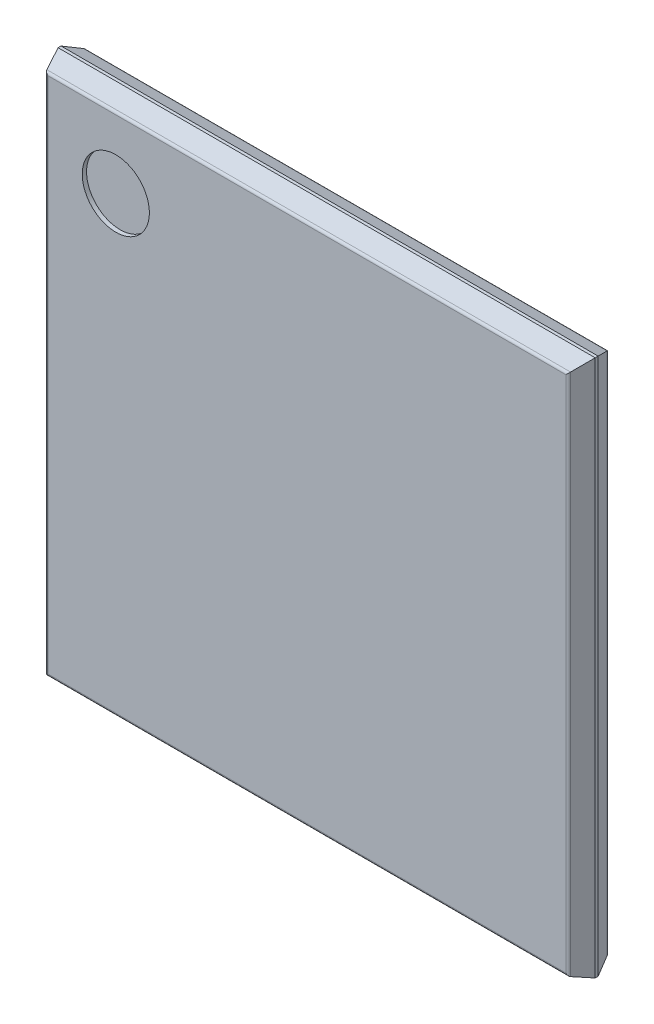
ISO-10303-21;
HEADER;
FILE_DESCRIPTION(('STEP AP214'),'2;1');
FILE_NAME('part.step','',(''),(''),'','','');
FILE_SCHEMA(('AUTOMOTIVE_DESIGN { 1 0 10303 214 1 1 1 1 }'));
ENDSEC;
DATA;
#1=APPLICATION_CONTEXT('core data for automotive mechanical design processes');
#2=APPLICATION_PROTOCOL_DEFINITION('international standard','automotive_design',2000,#1);
#3=PRODUCT_CONTEXT('',#1,'mechanical');
#4=PRODUCT('Part','Part','',(#3));
#5=PRODUCT_RELATED_PRODUCT_CATEGORY('part','',(#4));
#6=PRODUCT_DEFINITION_FORMATION('','',#4);
#7=PRODUCT_DEFINITION_CONTEXT('part definition',#1,'design');
#8=PRODUCT_DEFINITION('design','',#6,#7);
#9=PRODUCT_DEFINITION_SHAPE('','',#8);
#10=(LENGTH_UNIT() NAMED_UNIT(*) SI_UNIT(.MILLI.,.METRE.));
#11=(NAMED_UNIT(*) PLANE_ANGLE_UNIT() SI_UNIT($,.RADIAN.));
#12=(NAMED_UNIT(*) SI_UNIT($,.STERADIAN.) SOLID_ANGLE_UNIT());
#13=UNCERTAINTY_MEASURE_WITH_UNIT(LENGTH_MEASURE(1.E-05),#10,'distance_accuracy_value','');
#14=(GEOMETRIC_REPRESENTATION_CONTEXT(3) GLOBAL_UNCERTAINTY_ASSIGNED_CONTEXT((#13)) GLOBAL_UNIT_ASSIGNED_CONTEXT((#10,
#11,#12)) REPRESENTATION_CONTEXT('',''));
#15=CARTESIAN_POINT('',(0.,0.,0.));
#16=DIRECTION('',(0.,0.,1.));
#17=DIRECTION('',(1.,0.,0.));
#18=AXIS2_PLACEMENT_3D('',#15,#16,#17);
#19=CARTESIAN_POINT('',(-7.112,7.112,1.44));
#20=DIRECTION('',(0.,0.,1.));
#21=DIRECTION('',(1.,0.,0.));
#22=AXIS2_PLACEMENT_3D('',#19,#20,#21);
#23=PLANE('',#22);
#24=CARTESIAN_POINT('',(-7.112,7.112,1.44));
#25=DIRECTION('',(0.,0.,1.));
#26=DIRECTION('',(1.,0.,0.));
#27=AXIS2_PLACEMENT_3D('',#24,#25,#26);
#28=CIRCLE('',#27,1.25);
#29=CARTESIAN_POINT('',(-5.862,7.112,1.44));
#30=VERTEX_POINT('',#29);
#31=EDGE_CURVE('E25',#30,#30,#28,.T.);
#32=ORIENTED_EDGE('',*,*,#31,.T.);
#33=EDGE_LOOP('',(#32));
#34=FACE_BOUND('',#33,.T.);
#35=ADVANCED_FACE('F17',(#34),#23,.T.);
#36=CARTESIAN_POINT('',(-7.112,7.112,1.44));
#37=DIRECTION('',(0.,0.,1.));
#38=DIRECTION('',(1.,0.,0.));
#39=AXIS2_PLACEMENT_3D('',#36,#37,#38);
#40=CYLINDRICAL_SURFACE('',#39,1.25);
#41=ORIENTED_EDGE('',*,*,#31,.F.);
#42=DIRECTION('',(0.,0.,1.));
#43=VECTOR('',#42,1.);
#44=CARTESIAN_POINT('',(-5.862,7.112,1.44));
#45=LINE('',#44,#43);
#46=CARTESIAN_POINT('',(-5.862,7.112,1.6));
#47=VERTEX_POINT('',#46);
#48=EDGE_CURVE('E11',#30,#47,#45,.T.);
#49=ORIENTED_EDGE('',*,*,#48,.T.);
#50=CARTESIAN_POINT('',(-7.112,7.112,1.6));
#51=DIRECTION('',(0.,0.,1.));
#52=DIRECTION('',(1.,0.,0.));
#53=AXIS2_PLACEMENT_3D('',#50,#51,#52);
#54=CIRCLE('',#53,1.25);
#55=EDGE_CURVE('E263',#47,#47,#54,.T.);
#56=ORIENTED_EDGE('',*,*,#55,.T.);
#57=ORIENTED_EDGE('',*,*,#48,.F.);
#58=EDGE_LOOP('',(#41,#49,#56,#57));
#59=FACE_BOUND('',#58,.T.);
#60=ADVANCED_FACE('F335',(#59),#40,.F.);
#61=CARTESIAN_POINT('',(9.645902284743,-9.722,1.49));
#62=DIRECTION('',(0.,1.,0.));
#63=DIRECTION('',(0.,0.,1.));
#64=AXIS2_PLACEMENT_3D('',#61,#62,#63);
#65=CYLINDRICAL_SURFACE('',#64,0.11);
#66=CARTESIAN_POINT('',(9.645902284743,-9.645902284743,1.49));
#67=DIRECTION('',(-0.707106781186548,-0.707106781186548,0.));
#68=DIRECTION('',(0.707106781186548,-0.707106781186548,0.));
#69=AXIS2_PLACEMENT_3D('',#66,#67,#68);
#70=ELLIPSE('',#69,0.155563491861,0.11);
#71=CARTESIAN_POINT('',(9.748835540933,-9.748835540933,1.528791039818));
#72=VERTEX_POINT('',#71);
#73=CARTESIAN_POINT('',(9.645902284743,-9.645902284743,1.6));
#74=VERTEX_POINT('',#73);
#75=EDGE_CURVE('E215',#72,#74,#70,.T.);
#76=ORIENTED_EDGE('',*,*,#75,.F.);
#77=DIRECTION('',(0.,1.,0.));
#78=VECTOR('',#77,1.);
#79=CARTESIAN_POINT('',(9.748835540933,-9.722,1.528791039818));
#80=LINE('',#79,#78);
#81=CARTESIAN_POINT('',(9.748835540933,9.748835540933,1.528791039818));
#82=VERTEX_POINT('',#81);
#83=EDGE_CURVE('E220',#72,#82,#80,.T.);
#84=ORIENTED_EDGE('',*,*,#83,.T.);
#85=CARTESIAN_POINT('',(9.645902284743,9.645902284743,1.49));
#86=DIRECTION('',(-0.707106781186548,0.707106781186548,0.));
#87=DIRECTION('',(0.707106781186548,0.707106781186548,0.));
#88=AXIS2_PLACEMENT_3D('',#85,#86,#87);
#89=ELLIPSE('',#88,0.155563491861,0.11);
#90=CARTESIAN_POINT('',(9.645902284743,9.645902284743,1.6));
#91=VERTEX_POINT('',#90);
#92=EDGE_CURVE('E254',#91,#82,#89,.T.);
#93=ORIENTED_EDGE('',*,*,#92,.F.);
#94=DIRECTION('',(0.,1.,0.));
#95=VECTOR('',#94,1.);
#96=CARTESIAN_POINT('',(9.645902284743,-9.722,1.6));
#97=LINE('',#96,#95);
#98=EDGE_CURVE('E264',#74,#91,#97,.T.);
#99=ORIENTED_EDGE('',*,*,#98,.F.);
#100=EDGE_LOOP('',(#76,#84,#93,#99));
#101=FACE_BOUND('',#100,.T.);
#102=ADVANCED_FACE('F509',(#101),#65,.T.);
#103=CARTESIAN_POINT('',(-9.722,9.645902284743,1.49));
#104=DIRECTION('',(1.,0.,0.));
#105=DIRECTION('',(0.,0.,1.));
#106=AXIS2_PLACEMENT_3D('',#103,#104,#105);
#107=CYLINDRICAL_SURFACE('',#106,0.11);
#108=DIRECTION('',(1.,0.,0.));
#109=VECTOR('',#108,1.);
#110=CARTESIAN_POINT('',(-9.722,9.645902284743,1.6));
#111=LINE('',#110,#109);
#112=CARTESIAN_POINT('',(-9.645902284743,9.645902284743,1.6));
#113=VERTEX_POINT('',#112);
#114=EDGE_CURVE('E259',#113,#91,#111,.T.);
#115=ORIENTED_EDGE('',*,*,#114,.T.);
#116=ORIENTED_EDGE('',*,*,#92,.T.);
#117=DIRECTION('',(1.,0.,0.));
#118=VECTOR('',#117,1.);
#119=CARTESIAN_POINT('',(-9.722,9.748835540933,1.528791039818));
#120=LINE('',#119,#118);
#121=CARTESIAN_POINT('',(-9.748835540933,9.748835540933,1.528791039818));
#122=VERTEX_POINT('',#121);
#123=EDGE_CURVE('E316',#122,#82,#120,.T.);
#124=ORIENTED_EDGE('',*,*,#123,.F.);
#125=CARTESIAN_POINT('',(-9.645902284743,9.645902284743,1.49));
#126=DIRECTION('',(0.707106781186548,0.707106781186548,0.));
#127=DIRECTION('',(-0.707106781186548,0.707106781186548,0.));
#128=AXIS2_PLACEMENT_3D('',#125,#126,#127);
#129=ELLIPSE('',#128,0.155563491861,0.11);
#130=EDGE_CURVE('E269',#122,#113,#129,.T.);
#131=ORIENTED_EDGE('',*,*,#130,.T.);
#132=EDGE_LOOP('',(#115,#116,#124,#131));
#133=FACE_BOUND('',#132,.T.);
#134=ADVANCED_FACE('F341',(#133),#107,.T.);
#135=CARTESIAN_POINT('',(-10.,-10.,1.6));
#136=DIRECTION('',(0.,0.,1.));
#137=DIRECTION('',(1.,0.,0.));
#138=AXIS2_PLACEMENT_3D('',#135,#136,#137);
#139=PLANE('',#138);
#140=ORIENTED_EDGE('',*,*,#55,.F.);
#141=EDGE_LOOP('',(#140));
#142=FACE_BOUND('',#141,.T.);
#143=DIRECTION('',(0.,1.,0.));
#144=VECTOR('',#143,1.);
#145=CARTESIAN_POINT('',(-9.645902284743,-9.722,1.6));
#146=LINE('',#145,#144);
#147=CARTESIAN_POINT('',(-9.645902284743,-9.645902284743,1.6));
#148=VERTEX_POINT('',#147);
#149=EDGE_CURVE('E265',#148,#113,#146,.T.);
#150=ORIENTED_EDGE('',*,*,#149,.F.);
#151=DIRECTION('',(1.,0.,0.));
#152=VECTOR('',#151,1.);
#153=CARTESIAN_POINT('',(-9.722,-9.645902284743,1.6));
#154=LINE('',#153,#152);
#155=EDGE_CURVE('E219',#148,#74,#154,.T.);
#156=ORIENTED_EDGE('',*,*,#155,.T.);
#157=ORIENTED_EDGE('',*,*,#98,.T.);
#158=ORIENTED_EDGE('',*,*,#114,.F.);
#159=EDGE_LOOP('',(#150,#156,#157,#158));
#160=FACE_BOUND('',#159,.T.);
#161=ADVANCED_FACE('F337',(#142,#160),#139,.T.);
#162=CARTESIAN_POINT('',(-9.722,-9.645902284743,1.49));
#163=DIRECTION('',(1.,0.,0.));
#164=DIRECTION('',(0.,-0.935756874451536,0.352645816530825));
#165=AXIS2_PLACEMENT_3D('',#162,#163,#164);
#166=CYLINDRICAL_SURFACE('',#165,0.11);
#167=DIRECTION('',(1.,0.,0.));
#168=VECTOR('',#167,1.);
#169=CARTESIAN_POINT('',(-9.722,-9.748835540933,1.528791039818));
#170=LINE('',#169,#168);
#171=CARTESIAN_POINT('',(-9.748835540933,-9.748835540933,1.528791039818));
#172=VERTEX_POINT('',#171);
#173=EDGE_CURVE('E309',#172,#72,#170,.T.);
#174=ORIENTED_EDGE('',*,*,#173,.T.);
#175=ORIENTED_EDGE('',*,*,#75,.T.);
#176=ORIENTED_EDGE('',*,*,#155,.F.);
#177=CARTESIAN_POINT('',(-9.645902284743,-9.645902284743,1.49));
#178=DIRECTION('',(-0.707106781186548,0.707106781186548,0.));
#179=DIRECTION('',(0.707106781186548,0.707106781186548,0.));
#180=AXIS2_PLACEMENT_3D('',#177,#178,#179);
#181=ELLIPSE('',#180,0.155563491861,0.11);
#182=EDGE_CURVE('E270',#172,#148,#181,.T.);
#183=ORIENTED_EDGE('',*,*,#182,.F.);
#184=EDGE_LOOP('',(#174,#175,#176,#183));
#185=FACE_BOUND('',#184,.T.);
#186=ADVANCED_FACE('F340',(#185),#166,.T.);
#187=CARTESIAN_POINT('',(9.861,-10.,1.231159085259));
#188=DIRECTION('',(0.935756874451536,0.,0.352645816530825));
#189=DIRECTION('',(0.,-1.,0.));
#190=AXIS2_PLACEMENT_3D('',#187,#188,#189);
#191=PLANE('',#190);
#192=DIRECTION('',(-0.332572413353057,0.332572413353057,0.882491461575151));
#193=VECTOR('',#192,1.);
#194=CARTESIAN_POINT('',(8.770329911771,-8.770329911771,4.125286804851));
#195=LINE('',#194,#193);
#196=CARTESIAN_POINT('',(10.,-10.,0.862318170518));
#197=VERTEX_POINT('',#196);
#198=EDGE_CURVE('E305',#197,#72,#195,.T.);
#199=ORIENTED_EDGE('',*,*,#198,.F.);
#200=DIRECTION('',(0.,1.,0.));
#201=VECTOR('',#200,1.);
#202=CARTESIAN_POINT('',(10.,-10.,0.862318170518));
#203=LINE('',#202,#201);
#204=CARTESIAN_POINT('',(10.,10.,0.862318170518));
#205=VERTEX_POINT('',#204);
#206=EDGE_CURVE('E233',#197,#205,#203,.T.);
#207=ORIENTED_EDGE('',*,*,#206,.T.);
#208=DIRECTION('',(-0.332572413353057,-0.332572413353057,0.882491461575151));
#209=VECTOR('',#208,1.);
#210=CARTESIAN_POINT('',(7.664285810534,7.664285810534,7.060209956248));
#211=LINE('',#210,#209);
#212=EDGE_CURVE('E298',#205,#82,#211,.T.);
#213=ORIENTED_EDGE('',*,*,#212,.T.);
#214=ORIENTED_EDGE('',*,*,#83,.F.);
#215=EDGE_LOOP('',(#199,#207,#213,#214));
#216=FACE_BOUND('',#215,.T.);
#217=ADVANCED_FACE('F646',(#216),#191,.T.);
#218=CARTESIAN_POINT('',(-10.,9.861,1.231159085259));
#219=DIRECTION('',(0.,0.935756874451536,0.352645816530825));
#220=DIRECTION('',(1.,0.,0.));
#221=AXIS2_PLACEMENT_3D('',#218,#219,#220);
#222=PLANE('',#221);
#223=ORIENTED_EDGE('',*,*,#123,.T.);
#224=ORIENTED_EDGE('',*,*,#212,.F.);
#225=DIRECTION('',(1.,0.,0.));
#226=VECTOR('',#225,1.);
#227=CARTESIAN_POINT('',(-10.,10.,0.862318170518));
#228=LINE('',#227,#226);
#229=CARTESIAN_POINT('',(-10.,10.,0.862318170518));
#230=VERTEX_POINT('',#229);
#231=EDGE_CURVE('E229',#230,#205,#228,.T.);
#232=ORIENTED_EDGE('',*,*,#231,.F.);
#233=DIRECTION('',(0.332572413353057,-0.332572413353057,0.882491461575151));
#234=VECTOR('',#233,1.);
#235=CARTESIAN_POINT('',(-8.770329911771,8.770329911771,4.125286804851));
#236=LINE('',#235,#234);
#237=EDGE_CURVE('E285',#230,#122,#236,.T.);
#238=ORIENTED_EDGE('',*,*,#237,.T.);
#239=EDGE_LOOP('',(#223,#224,#232,#238));
#240=FACE_BOUND('',#239,.T.);
#241=ADVANCED_FACE('F533',(#240),#222,.T.);
#242=CARTESIAN_POINT('',(-9.645902284743,-9.722,1.49));
#243=DIRECTION('',(0.,1.,0.));
#244=DIRECTION('',(-0.935756874451536,0.,0.352645816530825));
#245=AXIS2_PLACEMENT_3D('',#242,#243,#244);
#246=CYLINDRICAL_SURFACE('',#245,0.11);
#247=ORIENTED_EDGE('',*,*,#182,.T.);
#248=ORIENTED_EDGE('',*,*,#149,.T.);
#249=ORIENTED_EDGE('',*,*,#130,.F.);
#250=DIRECTION('',(0.,1.,0.));
#251=VECTOR('',#250,1.);
#252=CARTESIAN_POINT('',(-9.748835540933,-9.722,1.528791039818));
#253=LINE('',#252,#251);
#254=EDGE_CURVE('E281',#172,#122,#253,.T.);
#255=ORIENTED_EDGE('',*,*,#254,.F.);
#256=EDGE_LOOP('',(#247,#248,#249,#255));
#257=FACE_BOUND('',#256,.T.);
#258=ADVANCED_FACE('F347',(#257),#246,.T.);
#259=CARTESIAN_POINT('',(-10.,-9.861,1.231159085259));
#260=DIRECTION('',(0.,0.935756874451536,-0.352645816530825));
#261=DIRECTION('',(-1.,0.,0.));
#262=AXIS2_PLACEMENT_3D('',#259,#260,#261);
#263=PLANE('',#262);
#264=DIRECTION('',(0.332572413353057,0.332572413353057,0.882491461575151));
#265=VECTOR('',#264,1.);
#266=CARTESIAN_POINT('',(-9.876374013007,-9.876374013007,1.190363653454));
#267=LINE('',#266,#265);
#268=CARTESIAN_POINT('',(-10.,-10.,0.862318170518));
#269=VERTEX_POINT('',#268);
#270=EDGE_CURVE('E291',#269,#172,#267,.T.);
#271=ORIENTED_EDGE('',*,*,#270,.F.);
#272=DIRECTION('',(1.,0.,0.));
#273=VECTOR('',#272,1.);
#274=CARTESIAN_POINT('',(-10.,-10.,0.862318170518));
#275=LINE('',#274,#273);
#276=EDGE_CURVE('E147',#269,#197,#275,.T.);
#277=ORIENTED_EDGE('',*,*,#276,.T.);
#278=ORIENTED_EDGE('',*,*,#198,.T.);
#279=ORIENTED_EDGE('',*,*,#173,.F.);
#280=EDGE_LOOP('',(#271,#277,#278,#279));
#281=FACE_BOUND('',#280,.T.);
#282=ADVANCED_FACE('F351',(#281),#263,.F.);
#283=CARTESIAN_POINT('',(10.,-10.,0.1));
#284=DIRECTION('',(1.,0.,0.));
#285=DIRECTION('',(0.,1.,0.));
#286=AXIS2_PLACEMENT_3D('',#283,#284,#285);
#287=PLANE('',#286);
#288=DIRECTION('',(0.,0.,1.));
#289=VECTOR('',#288,1.);
#290=CARTESIAN_POINT('',(10.,-10.,0.1));
#291=LINE('',#290,#289);
#292=CARTESIAN_POINT('',(10.,-10.,0.752318170518));
#293=VERTEX_POINT('',#292);
#294=EDGE_CURVE('E244',#293,#197,#291,.T.);
#295=ORIENTED_EDGE('',*,*,#294,.F.);
#296=DIRECTION('',(0.,1.,0.));
#297=VECTOR('',#296,1.);
#298=CARTESIAN_POINT('',(10.,-10.,0.752318170518));
#299=LINE('',#298,#297);
#300=CARTESIAN_POINT('',(10.,10.,0.752318170518));
#301=VERTEX_POINT('',#300);
#302=EDGE_CURVE('E251',#293,#301,#299,.T.);
#303=ORIENTED_EDGE('',*,*,#302,.T.);
#304=DIRECTION('',(0.,0.,1.));
#305=VECTOR('',#304,1.);
#306=CARTESIAN_POINT('',(10.,10.,0.1));
#307=LINE('',#306,#305);
#308=EDGE_CURVE('E234',#301,#205,#307,.T.);
#309=ORIENTED_EDGE('',*,*,#308,.T.);
#310=ORIENTED_EDGE('',*,*,#206,.F.);
#311=EDGE_LOOP('',(#295,#303,#309,#310));
#312=FACE_BOUND('',#311,.T.);
#313=ADVANCED_FACE('F546',(#312),#287,.T.);
#314=CARTESIAN_POINT('',(9.649306236035,-9.722,0.21));
#315=DIRECTION('',(0.,1.,0.));
#316=DIRECTION('',(0.,0.,-1.));
#317=AXIS2_PLACEMENT_3D('',#314,#315,#316);
#318=CYLINDRICAL_SURFACE('',#317,0.11);
#319=DIRECTION('',(0.,1.,0.));
#320=VECTOR('',#319,1.);
#321=CARTESIAN_POINT('',(9.649306236035,-9.722,0.1));
#322=LINE('',#321,#320);
#323=CARTESIAN_POINT('',(9.649306236035,-9.649306236035,0.1));
#324=VERTEX_POINT('',#323);
#325=CARTESIAN_POINT('',(9.649306236035,9.649306236035,0.1));
#326=VERTEX_POINT('',#325);
#327=EDGE_CURVE('E274',#324,#326,#322,.T.);
#328=ORIENTED_EDGE('',*,*,#327,.T.);
#329=CARTESIAN_POINT('',(9.649306236035,9.649306236035,0.21));
#330=DIRECTION('',(0.707106781186548,-0.707106781186548,0.));
#331=DIRECTION('',(0.707106781186548,0.707106781186548,0.));
#332=AXIS2_PLACEMENT_3D('',#329,#330,#331);
#333=ELLIPSE('',#332,0.155563491861,0.11);
#334=CARTESIAN_POINT('',(9.750499879527,9.750499879527,0.166874062134));
#335=VERTEX_POINT('',#334);
#336=EDGE_CURVE('E278',#326,#335,#333,.T.);
#337=ORIENTED_EDGE('',*,*,#336,.T.);
#338=DIRECTION('',(0.,1.,0.));
#339=VECTOR('',#338,1.);
#340=CARTESIAN_POINT('',(9.750499879527,-9.722,0.166874062134));
#341=LINE('',#340,#339);
#342=CARTESIAN_POINT('',(9.750499879527,-9.750499879527,0.166874062134));
#343=VERTEX_POINT('',#342);
#344=EDGE_CURVE('E247',#343,#335,#341,.T.);
#345=ORIENTED_EDGE('',*,*,#344,.F.);
#346=CARTESIAN_POINT('',(9.649306236035,-9.649306236035,0.21));
#347=DIRECTION('',(0.707106781186548,0.707106781186548,0.));
#348=DIRECTION('',(0.707106781186548,-0.707106781186548,0.));
#349=AXIS2_PLACEMENT_3D('',#346,#347,#348);
#350=ELLIPSE('',#349,0.155563491861,0.11);
#351=EDGE_CURVE('E238',#343,#324,#350,.T.);
#352=ORIENTED_EDGE('',*,*,#351,.T.);
#353=EDGE_LOOP('',(#328,#337,#345,#352));
#354=FACE_BOUND('',#353,.T.);
#355=ADVANCED_FACE('F551',(#354),#318,.T.);
#356=CARTESIAN_POINT('',(-10.,10.,0.1));
#357=DIRECTION('',(0.,1.,0.));
#358=DIRECTION('',(1.,0.,0.));
#359=AXIS2_PLACEMENT_3D('',#356,#357,#358);
#360=PLANE('',#359);
#361=ORIENTED_EDGE('',*,*,#308,.F.);
#362=DIRECTION('',(1.,0.,0.));
#363=VECTOR('',#362,1.);
#364=CARTESIAN_POINT('',(-10.,10.,0.752318170518));
#365=LINE('',#364,#363);
#366=CARTESIAN_POINT('',(-10.,10.,0.752318170518));
#367=VERTEX_POINT('',#366);
#368=EDGE_CURVE('E153',#367,#301,#365,.T.);
#369=ORIENTED_EDGE('',*,*,#368,.F.);
#370=DIRECTION('',(0.,0.,1.));
#371=VECTOR('',#370,1.);
#372=CARTESIAN_POINT('',(-10.,10.,0.1));
#373=LINE('',#372,#371);
#374=EDGE_CURVE('E154',#367,#230,#373,.T.);
#375=ORIENTED_EDGE('',*,*,#374,.T.);
#376=ORIENTED_EDGE('',*,*,#231,.T.);
#377=EDGE_LOOP('',(#361,#369,#375,#376));
#378=FACE_BOUND('',#377,.T.);
#379=ADVANCED_FACE('F357',(#378),#360,.T.);
#380=CARTESIAN_POINT('',(-9.861,-10.,1.231159085259));
#381=DIRECTION('',(0.935756874451536,0.,-0.352645816530825));
#382=DIRECTION('',(0.,-1.,0.));
#383=AXIS2_PLACEMENT_3D('',#380,#381,#382);
#384=PLANE('',#383);
#385=ORIENTED_EDGE('',*,*,#254,.T.);
#386=ORIENTED_EDGE('',*,*,#237,.F.);
#387=DIRECTION('',(0.,1.,0.));
#388=VECTOR('',#387,1.);
#389=CARTESIAN_POINT('',(-10.,-10.,0.862318170518));
#390=LINE('',#389,#388);
#391=EDGE_CURVE('E210',#269,#230,#390,.T.);
#392=ORIENTED_EDGE('',*,*,#391,.F.);
#393=ORIENTED_EDGE('',*,*,#270,.T.);
#394=EDGE_LOOP('',(#385,#386,#392,#393));
#395=FACE_BOUND('',#394,.T.);
#396=ADVANCED_FACE('F353',(#395),#384,.F.);
#397=CARTESIAN_POINT('',(-9.722,9.649306236035,0.21));
#398=DIRECTION('',(1.,0.,0.));
#399=DIRECTION('',(0.,0.,-1.));
#400=AXIS2_PLACEMENT_3D('',#397,#398,#399);
#401=CYLINDRICAL_SURFACE('',#400,0.11);
#402=CARTESIAN_POINT('',(-9.649306236035,9.649306236035,0.21));
#403=DIRECTION('',(-0.707106781186548,-0.707106781186548,0.));
#404=DIRECTION('',(-0.707106781186548,0.707106781186548,0.));
#405=AXIS2_PLACEMENT_3D('',#402,#403,#404);
#406=ELLIPSE('',#405,0.155563491861,0.11);
#407=CARTESIAN_POINT('',(-9.750499879527,9.750499879527,0.166874062134));
#408=VERTEX_POINT('',#407);
#409=CARTESIAN_POINT('',(-9.649306236035,9.649306236035,0.1));
#410=VERTEX_POINT('',#409);
#411=EDGE_CURVE('E165',#408,#410,#406,.T.);
#412=ORIENTED_EDGE('',*,*,#411,.F.);
#413=DIRECTION('',(1.,0.,0.));
#414=VECTOR('',#413,1.);
#415=CARTESIAN_POINT('',(-9.722,9.750499879527,0.166874062134));
#416=LINE('',#415,#414);
#417=EDGE_CURVE('E224',#408,#335,#416,.T.);
#418=ORIENTED_EDGE('',*,*,#417,.T.);
#419=ORIENTED_EDGE('',*,*,#336,.F.);
#420=DIRECTION('',(1.,0.,0.));
#421=VECTOR('',#420,1.);
#422=CARTESIAN_POINT('',(-9.722,9.649306236035,0.1));
#423=LINE('',#422,#421);
#424=EDGE_CURVE('E258',#410,#326,#423,.T.);
#425=ORIENTED_EDGE('',*,*,#424,.F.);
#426=EDGE_LOOP('',(#412,#418,#419,#425));
#427=FACE_BOUND('',#426,.T.);
#428=ADVANCED_FACE('F363',(#427),#401,.T.);
#429=CARTESIAN_POINT('',(-10.,-10.,0.1));
#430=DIRECTION('',(0.,0.,1.));
#431=DIRECTION('',(1.,0.,0.));
#432=AXIS2_PLACEMENT_3D('',#429,#430,#431);
#433=PLANE('',#432);
#434=ORIENTED_EDGE('',*,*,#424,.T.);
#435=ORIENTED_EDGE('',*,*,#327,.F.);
#436=DIRECTION('',(1.,0.,0.));
#437=VECTOR('',#436,1.);
#438=CARTESIAN_POINT('',(-9.722,-9.649306236035,0.1));
#439=LINE('',#438,#437);
#440=CARTESIAN_POINT('',(-9.649306236035,-9.649306236035,0.1));
#441=VERTEX_POINT('',#440);
#442=EDGE_CURVE('E228',#441,#324,#439,.T.);
#443=ORIENTED_EDGE('',*,*,#442,.F.);
#444=DIRECTION('',(0.,1.,0.));
#445=VECTOR('',#444,1.);
#446=CARTESIAN_POINT('',(-9.649306236035,-9.722,0.1));
#447=LINE('',#446,#445);
#448=EDGE_CURVE('E198',#441,#410,#447,.T.);
#449=ORIENTED_EDGE('',*,*,#448,.T.);
#450=EDGE_LOOP('',(#434,#435,#443,#449));
#451=FACE_BOUND('',#450,.T.);
#452=ADVANCED_FACE('F581',(#451),#433,.F.);
#453=CARTESIAN_POINT('',(9.861,-10.,0.426159085259));
#454=DIRECTION('',(-0.919942213562356,0.,0.392053980602152));
#455=DIRECTION('',(0.,1.,0.));
#456=AXIS2_PLACEMENT_3D('',#453,#454,#455);
#457=PLANE('',#456);
#458=ORIENTED_EDGE('',*,*,#344,.T.);
#459=DIRECTION('',(-0.365004510426897,-0.365004510426897,-0.856471490906757));
#460=VECTOR('',#459,1.);
#461=CARTESIAN_POINT('',(7.21495288004,7.21495288004,-5.782706441343));
#462=LINE('',#461,#460);
#463=EDGE_CURVE('E202',#301,#335,#462,.T.);
#464=ORIENTED_EDGE('',*,*,#463,.F.);
#465=ORIENTED_EDGE('',*,*,#302,.F.);
#466=DIRECTION('',(-0.365004510426897,0.365004510426897,-0.856471490906757));
#467=VECTOR('',#466,1.);
#468=CARTESIAN_POINT('',(8.547235806358,-8.547235806358,-2.656546869014));
#469=LINE('',#468,#467);
#470=EDGE_CURVE('E163',#293,#343,#469,.T.);
#471=ORIENTED_EDGE('',*,*,#470,.T.);
#472=EDGE_LOOP('',(#458,#464,#465,#471));
#473=FACE_BOUND('',#472,.T.);
#474=ADVANCED_FACE('F598',(#473),#457,.F.);
#475=CARTESIAN_POINT('',(-10.,-10.,0.1));
#476=DIRECTION('',(0.,1.,0.));
#477=DIRECTION('',(1.,0.,0.));
#478=AXIS2_PLACEMENT_3D('',#475,#476,#477);
#479=PLANE('',#478);
#480=ORIENTED_EDGE('',*,*,#276,.F.);
#481=DIRECTION('',(0.,0.,1.));
#482=VECTOR('',#481,1.);
#483=CARTESIAN_POINT('',(-10.,-10.,0.1));
#484=LINE('',#483,#482);
#485=CARTESIAN_POINT('',(-10.,-10.,0.752318170518));
#486=VERTEX_POINT('',#485);
#487=EDGE_CURVE('E140',#486,#269,#484,.T.);
#488=ORIENTED_EDGE('',*,*,#487,.F.);
#489=DIRECTION('',(1.,0.,0.));
#490=VECTOR('',#489,1.);
#491=CARTESIAN_POINT('',(-10.,-10.,0.752318170518));
#492=LINE('',#491,#490);
#493=EDGE_CURVE('E144',#486,#293,#492,.T.);
#494=ORIENTED_EDGE('',*,*,#493,.T.);
#495=ORIENTED_EDGE('',*,*,#294,.T.);
#496=EDGE_LOOP('',(#480,#488,#494,#495));
#497=FACE_BOUND('',#496,.T.);
#498=ADVANCED_FACE('F142',(#497),#479,.F.);
#499=CARTESIAN_POINT('',(-9.722,-9.649306236035,0.21));
#500=DIRECTION('',(1.,0.,0.));
#501=DIRECTION('',(0.,-0.919942213562356,-0.392053980602152));
#502=AXIS2_PLACEMENT_3D('',#499,#500,#501);
#503=CYLINDRICAL_SURFACE('',#502,0.11);
#504=CARTESIAN_POINT('',(-9.649306236035,-9.649306236035,0.21));
#505=DIRECTION('',(0.707106781186548,-0.707106781186548,0.));
#506=DIRECTION('',(0.707106781186548,0.707106781186548,0.));
#507=AXIS2_PLACEMENT_3D('',#504,#505,#506);
#508=ELLIPSE('',#507,0.155563491861,0.11);
#509=CARTESIAN_POINT('',(-9.750499879527,-9.750499879527,0.166874062134));
#510=VERTEX_POINT('',#509);
#511=EDGE_CURVE('E206',#510,#441,#508,.T.);
#512=ORIENTED_EDGE('',*,*,#511,.T.);
#513=ORIENTED_EDGE('',*,*,#442,.T.);
#514=ORIENTED_EDGE('',*,*,#351,.F.);
#515=DIRECTION('',(1.,0.,0.));
#516=VECTOR('',#515,1.);
#517=CARTESIAN_POINT('',(-9.722,-9.750499879527,0.166874062134));
#518=LINE('',#517,#516);
#519=EDGE_CURVE('E192',#510,#343,#518,.T.);
#520=ORIENTED_EDGE('',*,*,#519,.F.);
#521=EDGE_LOOP('',(#512,#513,#514,#520));
#522=FACE_BOUND('',#521,.T.);
#523=ADVANCED_FACE('F572',(#522),#503,.T.);
#524=CARTESIAN_POINT('',(-10.,9.861,0.426159085259));
#525=DIRECTION('',(0.,-0.919942213562356,0.392053980602152));
#526=DIRECTION('',(-1.,0.,0.));
#527=AXIS2_PLACEMENT_3D('',#524,#525,#526);
#528=PLANE('',#527);
#529=DIRECTION('',(0.365004510426897,-0.365004510426897,-0.856471490906757));
#530=VECTOR('',#529,1.);
#531=CARTESIAN_POINT('',(-8.547235806358,8.547235806358,-2.656546869014));
#532=LINE('',#531,#530);
#533=EDGE_CURVE('E176',#367,#408,#532,.T.);
#534=ORIENTED_EDGE('',*,*,#533,.F.);
#535=ORIENTED_EDGE('',*,*,#368,.T.);
#536=ORIENTED_EDGE('',*,*,#463,.T.);
#537=ORIENTED_EDGE('',*,*,#417,.F.);
#538=EDGE_LOOP('',(#534,#535,#536,#537));
#539=FACE_BOUND('',#538,.T.);
#540=ADVANCED_FACE('F359',(#539),#528,.F.);
#541=CARTESIAN_POINT('',(-10.,-10.,0.1));
#542=DIRECTION('',(1.,0.,0.));
#543=DIRECTION('',(0.,1.,0.));
#544=AXIS2_PLACEMENT_3D('',#541,#542,#543);
#545=PLANE('',#544);
#546=ORIENTED_EDGE('',*,*,#391,.T.);
#547=ORIENTED_EDGE('',*,*,#374,.F.);
#548=DIRECTION('',(0.,1.,0.));
#549=VECTOR('',#548,1.);
#550=CARTESIAN_POINT('',(-10.,-10.,0.752318170518));
#551=LINE('',#550,#549);
#552=EDGE_CURVE('E169',#486,#367,#551,.T.);
#553=ORIENTED_EDGE('',*,*,#552,.F.);
#554=ORIENTED_EDGE('',*,*,#487,.T.);
#555=EDGE_LOOP('',(#546,#547,#553,#554));
#556=FACE_BOUND('',#555,.T.);
#557=ADVANCED_FACE('F170',(#556),#545,.F.);
#558=CARTESIAN_POINT('',(-9.649306236035,-9.722,0.21));
#559=DIRECTION('',(0.,1.,0.));
#560=DIRECTION('',(-0.919942213562356,0.,-0.392053980602152));
#561=AXIS2_PLACEMENT_3D('',#558,#559,#560);
#562=CYLINDRICAL_SURFACE('',#561,0.11);
#563=DIRECTION('',(0.,1.,0.));
#564=VECTOR('',#563,1.);
#565=CARTESIAN_POINT('',(-9.750499879527,-9.722,0.166874062134));
#566=LINE('',#565,#564);
#567=EDGE_CURVE('E181',#510,#408,#566,.T.);
#568=ORIENTED_EDGE('',*,*,#567,.T.);
#569=ORIENTED_EDGE('',*,*,#411,.T.);
#570=ORIENTED_EDGE('',*,*,#448,.F.);
#571=ORIENTED_EDGE('',*,*,#511,.F.);
#572=EDGE_LOOP('',(#568,#569,#570,#571));
#573=FACE_BOUND('',#572,.T.);
#574=ADVANCED_FACE('F366',(#573),#562,.T.);
#575=CARTESIAN_POINT('',(-10.,-9.861,0.426159085259));
#576=DIRECTION('',(0.,-0.919942213562356,-0.392053980602152));
#577=DIRECTION('',(0.,0.392053980602152,-0.919942213562356));
#578=AXIS2_PLACEMENT_3D('',#575,#576,#577);
#579=PLANE('',#578);
#580=ORIENTED_EDGE('',*,*,#519,.T.);
#581=ORIENTED_EDGE('',*,*,#470,.F.);
#582=ORIENTED_EDGE('',*,*,#493,.F.);
#583=DIRECTION('',(0.365004510426897,0.365004510426897,-0.856471490906757));
#584=VECTOR('',#583,1.);
#585=CARTESIAN_POINT('',(-9.879518732676,-9.879518732676,0.469612703314));
#586=LINE('',#585,#584);
#587=EDGE_CURVE('E161',#486,#510,#586,.T.);
#588=ORIENTED_EDGE('',*,*,#587,.T.);
#589=EDGE_LOOP('',(#580,#581,#582,#588));
#590=FACE_BOUND('',#589,.T.);
#591=ADVANCED_FACE('F159',(#590),#579,.T.);
#592=CARTESIAN_POINT('',(-9.861,-10.,0.426159085259));
#593=DIRECTION('',(-0.919942213562356,0.,-0.392053980602152));
#594=DIRECTION('',(-0.392053980602152,0.,0.919942213562356));
#595=AXIS2_PLACEMENT_3D('',#592,#593,#594);
#596=PLANE('',#595);
#597=ORIENTED_EDGE('',*,*,#587,.F.);
#598=ORIENTED_EDGE('',*,*,#552,.T.);
#599=ORIENTED_EDGE('',*,*,#533,.T.);
#600=ORIENTED_EDGE('',*,*,#567,.F.);
#601=EDGE_LOOP('',(#597,#598,#599,#600));
#602=FACE_BOUND('',#601,.T.);
#603=ADVANCED_FACE('F179',(#602),#596,.T.);
#604=CLOSED_SHELL('',(#35,#60,#102,#134,#161,#186,#217,#241,#258,#282,#313,#355,#379,#396,#428,
#452,#474,#498,#523,#540,#557,#574,#591,#603));
#605=MANIFOLD_SOLID_BREP('B1',#604);
#606=ADVANCED_BREP_SHAPE_REPRESENTATION('',(#18,#605),#14);
#607=SHAPE_DEFINITION_REPRESENTATION(#9,#606);
ENDSEC;
END-ISO-10303-21;
